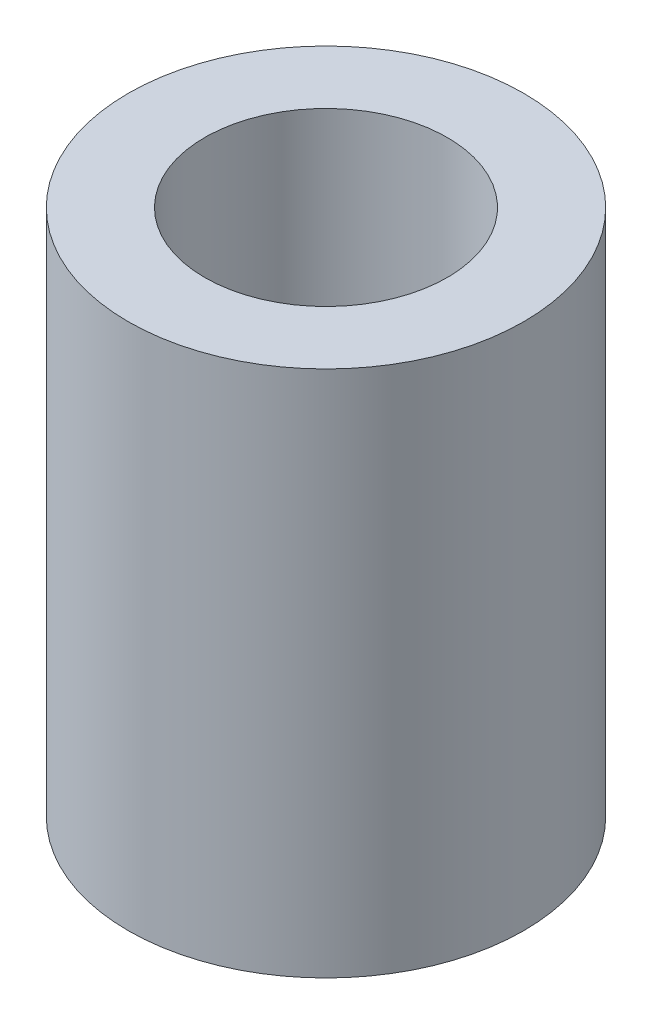
ISO-10303-21;
HEADER;
FILE_DESCRIPTION(('STEP AP214'),'2;1');
FILE_NAME('part.step','',(''),(''),'','','');
FILE_SCHEMA(('AUTOMOTIVE_DESIGN { 1 0 10303 214 1 1 1 1 }'));
ENDSEC;
DATA;
#1=APPLICATION_CONTEXT('core data for automotive mechanical design processes');
#2=APPLICATION_PROTOCOL_DEFINITION('international standard','automotive_design',2000,#1);
#3=PRODUCT_CONTEXT('',#1,'mechanical');
#4=PRODUCT('Part','Part','',(#3));
#5=PRODUCT_RELATED_PRODUCT_CATEGORY('part','',(#4));
#6=PRODUCT_DEFINITION_FORMATION('','',#4);
#7=PRODUCT_DEFINITION_CONTEXT('part definition',#1,'design');
#8=PRODUCT_DEFINITION('design','',#6,#7);
#9=PRODUCT_DEFINITION_SHAPE('','',#8);
#10=(LENGTH_UNIT() NAMED_UNIT(*) SI_UNIT(.MILLI.,.METRE.));
#11=(NAMED_UNIT(*) PLANE_ANGLE_UNIT() SI_UNIT($,.RADIAN.));
#12=(NAMED_UNIT(*) SI_UNIT($,.STERADIAN.) SOLID_ANGLE_UNIT());
#13=UNCERTAINTY_MEASURE_WITH_UNIT(LENGTH_MEASURE(1.E-05),#10,'distance_accuracy_value','');
#14=(GEOMETRIC_REPRESENTATION_CONTEXT(3) GLOBAL_UNCERTAINTY_ASSIGNED_CONTEXT((#13)) GLOBAL_UNIT_ASSIGNED_CONTEXT((#10,
#11,#12)) REPRESENTATION_CONTEXT('',''));
#15=CARTESIAN_POINT('',(0.,0.,0.));
#16=DIRECTION('',(0.,0.,1.));
#17=DIRECTION('',(1.,0.,0.));
#18=AXIS2_PLACEMENT_3D('',#15,#16,#17);
#19=CARTESIAN_POINT('',(0.,6.35,0.));
#20=DIRECTION('',(0.,1.,0.));
#21=DIRECTION('',(0.,0.,1.));
#22=AXIS2_PLACEMENT_3D('',#19,#20,#21);
#23=PLANE('',#22);
#24=CARTESIAN_POINT('',(0.,6.35,0.));
#25=DIRECTION('',(0.,1.,0.));
#26=DIRECTION('',(0.,0.,1.));
#27=AXIS2_PLACEMENT_3D('',#24,#25,#26);
#28=CIRCLE('',#27,2.38125);
#29=CARTESIAN_POINT('',(0.,6.35,2.38125));
#30=VERTEX_POINT('',#29);
#31=EDGE_CURVE('E10',#30,#30,#28,.T.);
#32=ORIENTED_EDGE('',*,*,#31,.T.);
#33=EDGE_LOOP('',(#32));
#34=FACE_BOUND('',#33,.T.);
#35=CARTESIAN_POINT('',(0.,6.35,0.));
#36=DIRECTION('',(0.,1.,0.));
#37=DIRECTION('',(0.,0.,1.));
#38=AXIS2_PLACEMENT_3D('',#35,#36,#37);
#39=CIRCLE('',#38,1.4605);
#40=CARTESIAN_POINT('',(0.,6.35,1.4605));
#41=VERTEX_POINT('',#40);
#42=EDGE_CURVE('E42',#41,#41,#39,.T.);
#43=ORIENTED_EDGE('',*,*,#42,.F.);
#44=EDGE_LOOP('',(#43));
#45=FACE_BOUND('',#44,.T.);
#46=ADVANCED_FACE('F31',(#34,#45),#23,.T.);
#47=CARTESIAN_POINT('',(0.,0.,0.));
#48=DIRECTION('',(0.,1.,0.));
#49=DIRECTION('',(0.,0.,1.));
#50=AXIS2_PLACEMENT_3D('',#47,#48,#49);
#51=PLANE('',#50);
#52=CARTESIAN_POINT('',(0.,0.,0.));
#53=DIRECTION('',(0.,1.,0.));
#54=DIRECTION('',(0.,0.,1.));
#55=AXIS2_PLACEMENT_3D('',#52,#53,#54);
#56=CIRCLE('',#55,2.38125);
#57=CARTESIAN_POINT('',(0.,0.,2.38125));
#58=VERTEX_POINT('',#57);
#59=EDGE_CURVE('E35',#58,#58,#56,.T.);
#60=ORIENTED_EDGE('',*,*,#59,.F.);
#61=EDGE_LOOP('',(#60));
#62=FACE_BOUND('',#61,.T.);
#63=CARTESIAN_POINT('',(0.,0.,0.));
#64=DIRECTION('',(0.,1.,0.));
#65=DIRECTION('',(0.,0.,1.));
#66=AXIS2_PLACEMENT_3D('',#63,#64,#65);
#67=CIRCLE('',#66,1.4605);
#68=CARTESIAN_POINT('',(0.,0.,1.4605));
#69=VERTEX_POINT('',#68);
#70=EDGE_CURVE('E44',#69,#69,#67,.T.);
#71=ORIENTED_EDGE('',*,*,#70,.T.);
#72=EDGE_LOOP('',(#71));
#73=FACE_BOUND('',#72,.T.);
#74=ADVANCED_FACE('F54',(#62,#73),#51,.F.);
#75=CARTESIAN_POINT('',(0.,6.35,0.));
#76=DIRECTION('',(0.,-1.,0.));
#77=DIRECTION('',(0.,0.,-1.));
#78=AXIS2_PLACEMENT_3D('',#75,#76,#77);
#79=CYLINDRICAL_SURFACE('',#78,2.38125);
#80=ORIENTED_EDGE('',*,*,#31,.F.);
#81=EDGE_LOOP('',(#80));
#82=FACE_BOUND('',#81,.T.);
#83=ORIENTED_EDGE('',*,*,#59,.T.);
#84=EDGE_LOOP('',(#83));
#85=FACE_BOUND('',#84,.T.);
#86=ADVANCED_FACE('F33',(#82,#85),#79,.T.);
#87=CARTESIAN_POINT('',(0.,6.35,0.));
#88=DIRECTION('',(0.,-1.,0.));
#89=DIRECTION('',(0.,0.,-1.));
#90=AXIS2_PLACEMENT_3D('',#87,#88,#89);
#91=CYLINDRICAL_SURFACE('',#90,1.4605);
#92=ORIENTED_EDGE('',*,*,#42,.T.);
#93=EDGE_LOOP('',(#92));
#94=FACE_BOUND('',#93,.T.);
#95=ORIENTED_EDGE('',*,*,#70,.F.);
#96=EDGE_LOOP('',(#95));
#97=FACE_BOUND('',#96,.T.);
#98=ADVANCED_FACE('F50',(#94,#97),#91,.F.);
#99=CLOSED_SHELL('',(#46,#74,#86,#98));
#100=MANIFOLD_SOLID_BREP('B2',#99);
#101=ADVANCED_BREP_SHAPE_REPRESENTATION('',(#18,#100),#14);
#102=SHAPE_DEFINITION_REPRESENTATION(#9,#101);
ENDSEC;
END-ISO-10303-21;
